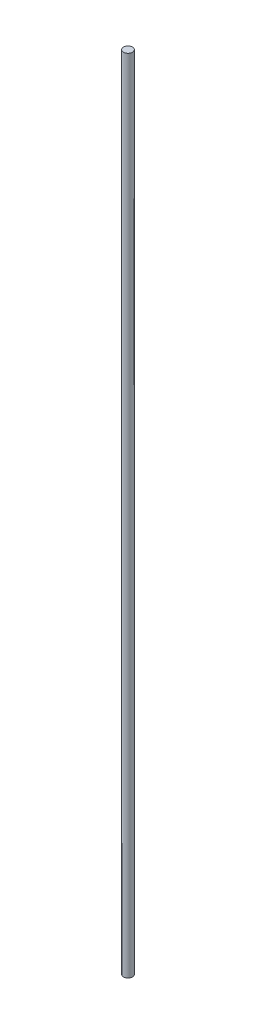
ISO-10303-21;
HEADER;
FILE_DESCRIPTION(('STEP AP214'),'2;1');
FILE_NAME('part.step','',(''),(''),'','','');
FILE_SCHEMA(('AUTOMOTIVE_DESIGN { 1 0 10303 214 1 1 1 1 }'));
ENDSEC;
DATA;
#1=APPLICATION_CONTEXT('core data for automotive mechanical design processes');
#2=APPLICATION_PROTOCOL_DEFINITION('international standard','automotive_design',2000,#1);
#3=PRODUCT_CONTEXT('',#1,'mechanical');
#4=PRODUCT('Part','Part','',(#3));
#5=PRODUCT_RELATED_PRODUCT_CATEGORY('part','',(#4));
#6=PRODUCT_DEFINITION_FORMATION('','',#4);
#7=PRODUCT_DEFINITION_CONTEXT('part definition',#1,'design');
#8=PRODUCT_DEFINITION('design','',#6,#7);
#9=PRODUCT_DEFINITION_SHAPE('','',#8);
#10=(LENGTH_UNIT() NAMED_UNIT(*) SI_UNIT(.MILLI.,.METRE.));
#11=(NAMED_UNIT(*) PLANE_ANGLE_UNIT() SI_UNIT($,.RADIAN.));
#12=(NAMED_UNIT(*) SI_UNIT($,.STERADIAN.) SOLID_ANGLE_UNIT());
#13=UNCERTAINTY_MEASURE_WITH_UNIT(LENGTH_MEASURE(1.E-05),#10,'distance_accuracy_value','');
#14=(GEOMETRIC_REPRESENTATION_CONTEXT(3) GLOBAL_UNCERTAINTY_ASSIGNED_CONTEXT((#13)) GLOBAL_UNIT_ASSIGNED_CONTEXT((#10,
#11,#12)) REPRESENTATION_CONTEXT('',''));
#15=CARTESIAN_POINT('',(0.,0.,0.));
#16=DIRECTION('',(0.,0.,1.));
#17=DIRECTION('',(1.,0.,0.));
#18=AXIS2_PLACEMENT_3D('',#15,#16,#17);
#19=CARTESIAN_POINT('',(0.,3403.6,0.));
#20=DIRECTION('',(0.,-1.,0.));
#21=DIRECTION('',(0.,0.,-1.));
#22=AXIS2_PLACEMENT_3D('',#19,#20,#21);
#23=CYLINDRICAL_SURFACE('',#22,19.05);
#24=CARTESIAN_POINT('',(0.,3403.6,0.));
#25=DIRECTION('',(0.,1.,0.));
#26=DIRECTION('',(0.,0.,1.));
#27=AXIS2_PLACEMENT_3D('',#24,#25,#26);
#28=CIRCLE('',#27,19.05);
#29=CARTESIAN_POINT('',(0.,3403.6,19.05));
#30=VERTEX_POINT('',#29);
#31=EDGE_CURVE('E10',#30,#30,#28,.T.);
#32=ORIENTED_EDGE('',*,*,#31,.F.);
#33=EDGE_LOOP('',(#32));
#34=FACE_BOUND('',#33,.T.);
#35=CARTESIAN_POINT('',(0.,0.,0.));
#36=DIRECTION('',(0.,1.,0.));
#37=DIRECTION('',(0.,0.,1.));
#38=AXIS2_PLACEMENT_3D('',#35,#36,#37);
#39=CIRCLE('',#38,19.05);
#40=CARTESIAN_POINT('',(0.,0.,19.05));
#41=VERTEX_POINT('',#40);
#42=EDGE_CURVE('E34',#41,#41,#39,.T.);
#43=ORIENTED_EDGE('',*,*,#42,.T.);
#44=EDGE_LOOP('',(#43));
#45=FACE_BOUND('',#44,.T.);
#46=ADVANCED_FACE('F31',(#34,#45),#23,.T.);
#47=CARTESIAN_POINT('',(0.,3403.6,0.));
#48=DIRECTION('',(0.,1.,0.));
#49=DIRECTION('',(0.,0.,1.));
#50=AXIS2_PLACEMENT_3D('',#47,#48,#49);
#51=PLANE('',#50);
#52=ORIENTED_EDGE('',*,*,#31,.T.);
#53=EDGE_LOOP('',(#52));
#54=FACE_BOUND('',#53,.T.);
#55=ADVANCED_FACE('F46',(#54),#51,.T.);
#56=CARTESIAN_POINT('',(0.,0.,0.));
#57=DIRECTION('',(0.,1.,0.));
#58=DIRECTION('',(0.,0.,1.));
#59=AXIS2_PLACEMENT_3D('',#56,#57,#58);
#60=PLANE('',#59);
#61=ORIENTED_EDGE('',*,*,#42,.F.);
#62=EDGE_LOOP('',(#61));
#63=FACE_BOUND('',#62,.T.);
#64=ADVANCED_FACE('F44',(#63),#60,.F.);
#65=CLOSED_SHELL('',(#46,#55,#64));
#66=MANIFOLD_SOLID_BREP('B2',#65);
#67=ADVANCED_BREP_SHAPE_REPRESENTATION('',(#18,#66),#14);
#68=SHAPE_DEFINITION_REPRESENTATION(#9,#67);
ENDSEC;
END-ISO-10303-21;
